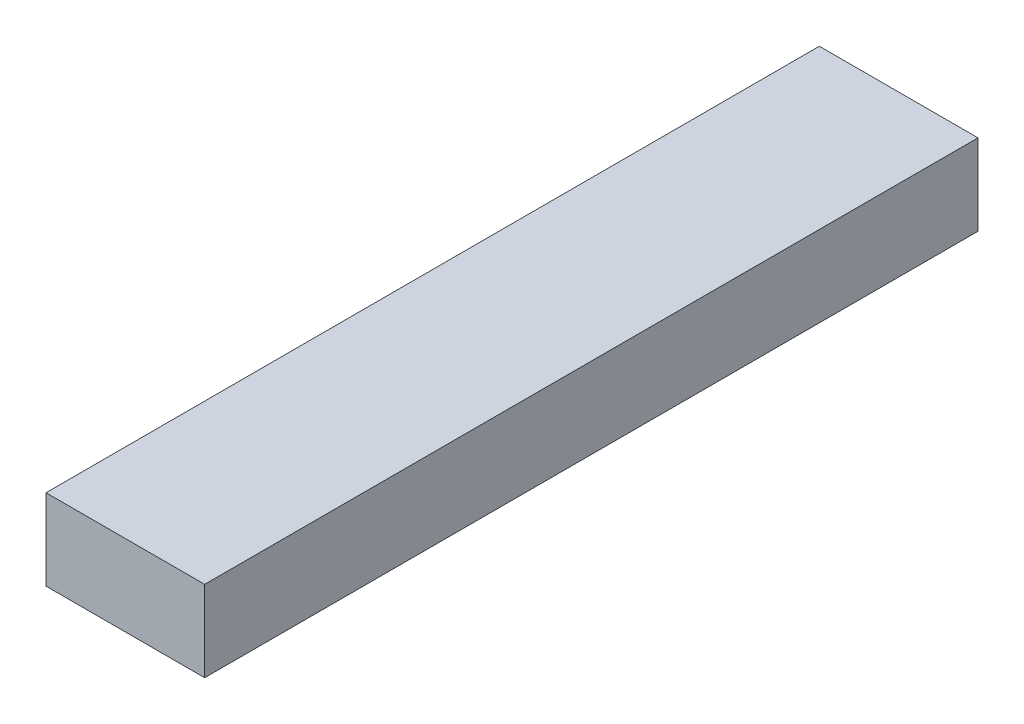
ISO-10303-21;
HEADER;
FILE_DESCRIPTION(('STEP AP214'),'2;1');
FILE_NAME('part.step','',(''),(''),'','','');
FILE_SCHEMA(('AUTOMOTIVE_DESIGN { 1 0 10303 214 1 1 1 1 }'));
ENDSEC;
DATA;
#1=APPLICATION_CONTEXT('core data for automotive mechanical design processes');
#2=APPLICATION_PROTOCOL_DEFINITION('international standard','automotive_design',2000,#1);
#3=PRODUCT_CONTEXT('',#1,'mechanical');
#4=PRODUCT('Part','Part','',(#3));
#5=PRODUCT_RELATED_PRODUCT_CATEGORY('part','',(#4));
#6=PRODUCT_DEFINITION_FORMATION('','',#4);
#7=PRODUCT_DEFINITION_CONTEXT('part definition',#1,'design');
#8=PRODUCT_DEFINITION('design','',#6,#7);
#9=PRODUCT_DEFINITION_SHAPE('','',#8);
#10=(LENGTH_UNIT() NAMED_UNIT(*) SI_UNIT(.MILLI.,.METRE.));
#11=(NAMED_UNIT(*) PLANE_ANGLE_UNIT() SI_UNIT($,.RADIAN.));
#12=(NAMED_UNIT(*) SI_UNIT($,.STERADIAN.) SOLID_ANGLE_UNIT());
#13=UNCERTAINTY_MEASURE_WITH_UNIT(LENGTH_MEASURE(1.E-05),#10,'distance_accuracy_value','');
#14=(GEOMETRIC_REPRESENTATION_CONTEXT(3) GLOBAL_UNCERTAINTY_ASSIGNED_CONTEXT((#13)) GLOBAL_UNIT_ASSIGNED_CONTEXT((#10,
#11,#12)) REPRESENTATION_CONTEXT('',''));
#15=CARTESIAN_POINT('',(0.,0.,0.));
#16=DIRECTION('',(0.,0.,1.));
#17=DIRECTION('',(1.,0.,0.));
#18=AXIS2_PLACEMENT_3D('',#15,#16,#17);
#19=CARTESIAN_POINT('',(0.,7.7,0.));
#20=DIRECTION('',(1.,0.,0.));
#21=DIRECTION('',(0.,0.,-1.));
#22=AXIS2_PLACEMENT_3D('',#19,#20,#21);
#23=PLANE('',#22);
#24=DIRECTION('',(0.,0.,1.));
#25=VECTOR('',#24,1.);
#26=CARTESIAN_POINT('',(0.,0.,0.));
#27=LINE('',#26,#25);
#28=CARTESIAN_POINT('',(0.,0.,-73.6));
#29=VERTEX_POINT('',#28);
#30=CARTESIAN_POINT('',(0.,0.,0.));
#31=VERTEX_POINT('',#30);
#32=EDGE_CURVE('E95',#29,#31,#27,.T.);
#33=ORIENTED_EDGE('',*,*,#32,.T.);
#34=DIRECTION('',(0.,-1.,0.));
#35=VECTOR('',#34,1.);
#36=CARTESIAN_POINT('',(0.,7.7,0.));
#37=LINE('',#36,#35);
#38=CARTESIAN_POINT('',(0.,7.7,0.));
#39=VERTEX_POINT('',#38);
#40=EDGE_CURVE('E11',#39,#31,#37,.T.);
#41=ORIENTED_EDGE('',*,*,#40,.F.);
#42=DIRECTION('',(0.,0.,1.));
#43=VECTOR('',#42,1.);
#44=CARTESIAN_POINT('',(0.,7.7,0.));
#45=LINE('',#44,#43);
#46=CARTESIAN_POINT('',(0.,7.7,-73.6));
#47=VERTEX_POINT('',#46);
#48=EDGE_CURVE('E83',#47,#39,#45,.T.);
#49=ORIENTED_EDGE('',*,*,#48,.F.);
#50=DIRECTION('',(0.,-1.,0.));
#51=VECTOR('',#50,1.);
#52=CARTESIAN_POINT('',(0.,7.7,-73.6));
#53=LINE('',#52,#51);
#54=EDGE_CURVE('E91',#47,#29,#53,.T.);
#55=ORIENTED_EDGE('',*,*,#54,.T.);
#56=EDGE_LOOP('',(#33,#41,#49,#55));
#57=FACE_BOUND('',#56,.T.);
#58=ADVANCED_FACE('F32',(#57),#23,.F.);
#59=CARTESIAN_POINT('',(0.,7.7,0.));
#60=DIRECTION('',(0.,0.,-1.));
#61=DIRECTION('',(-1.,0.,0.));
#62=AXIS2_PLACEMENT_3D('',#59,#60,#61);
#63=PLANE('',#62);
#64=DIRECTION('',(1.,0.,0.));
#65=VECTOR('',#64,1.);
#66=CARTESIAN_POINT('',(0.,0.,0.));
#67=LINE('',#66,#65);
#68=CARTESIAN_POINT('',(15.1,0.,0.));
#69=VERTEX_POINT('',#68);
#70=EDGE_CURVE('E87',#31,#69,#67,.T.);
#71=ORIENTED_EDGE('',*,*,#70,.T.);
#72=DIRECTION('',(0.,-1.,0.));
#73=VECTOR('',#72,1.);
#74=CARTESIAN_POINT('',(15.1,7.7,0.));
#75=LINE('',#74,#73);
#76=CARTESIAN_POINT('',(15.1,7.7,0.));
#77=VERTEX_POINT('',#76);
#78=EDGE_CURVE('E40',#77,#69,#75,.T.);
#79=ORIENTED_EDGE('',*,*,#78,.F.);
#80=DIRECTION('',(1.,0.,0.));
#81=VECTOR('',#80,1.);
#82=CARTESIAN_POINT('',(0.,7.7,0.));
#83=LINE('',#82,#81);
#84=EDGE_CURVE('E78',#39,#77,#83,.T.);
#85=ORIENTED_EDGE('',*,*,#84,.F.);
#86=ORIENTED_EDGE('',*,*,#40,.T.);
#87=EDGE_LOOP('',(#71,#79,#85,#86));
#88=FACE_BOUND('',#87,.T.);
#89=ADVANCED_FACE('F86',(#88),#63,.F.);
#90=CARTESIAN_POINT('',(15.1,7.7,0.));
#91=DIRECTION('',(-1.,0.,0.));
#92=DIRECTION('',(0.,0.,1.));
#93=AXIS2_PLACEMENT_3D('',#90,#91,#92);
#94=PLANE('',#93);
#95=DIRECTION('',(0.,0.,-1.));
#96=VECTOR('',#95,1.);
#97=CARTESIAN_POINT('',(15.1,0.,0.));
#98=LINE('',#97,#96);
#99=CARTESIAN_POINT('',(15.1,0.,-73.6));
#100=VERTEX_POINT('',#99);
#101=EDGE_CURVE('E65',#69,#100,#98,.T.);
#102=ORIENTED_EDGE('',*,*,#101,.T.);
#103=DIRECTION('',(0.,-1.,0.));
#104=VECTOR('',#103,1.);
#105=CARTESIAN_POINT('',(15.1,7.7,-73.6));
#106=LINE('',#105,#104);
#107=CARTESIAN_POINT('',(15.1,7.7,-73.6));
#108=VERTEX_POINT('',#107);
#109=EDGE_CURVE('E88',#108,#100,#106,.T.);
#110=ORIENTED_EDGE('',*,*,#109,.F.);
#111=DIRECTION('',(0.,0.,-1.));
#112=VECTOR('',#111,1.);
#113=CARTESIAN_POINT('',(15.1,7.7,0.));
#114=LINE('',#113,#112);
#115=EDGE_CURVE('E81',#77,#108,#114,.T.);
#116=ORIENTED_EDGE('',*,*,#115,.F.);
#117=ORIENTED_EDGE('',*,*,#78,.T.);
#118=EDGE_LOOP('',(#102,#110,#116,#117));
#119=FACE_BOUND('',#118,.T.);
#120=ADVANCED_FACE('F89',(#119),#94,.F.);
#121=CARTESIAN_POINT('',(0.,7.7,-73.6));
#122=DIRECTION('',(0.,0.,1.));
#123=DIRECTION('',(1.,0.,0.));
#124=AXIS2_PLACEMENT_3D('',#121,#122,#123);
#125=PLANE('',#124);
#126=DIRECTION('',(-1.,0.,0.));
#127=VECTOR('',#126,1.);
#128=CARTESIAN_POINT('',(0.,0.,-73.6));
#129=LINE('',#128,#127);
#130=EDGE_CURVE('E71',#100,#29,#129,.T.);
#131=ORIENTED_EDGE('',*,*,#130,.T.);
#132=ORIENTED_EDGE('',*,*,#54,.F.);
#133=DIRECTION('',(-1.,0.,0.));
#134=VECTOR('',#133,1.);
#135=CARTESIAN_POINT('',(0.,7.7,-73.6));
#136=LINE('',#135,#134);
#137=EDGE_CURVE('E48',#108,#47,#136,.T.);
#138=ORIENTED_EDGE('',*,*,#137,.F.);
#139=ORIENTED_EDGE('',*,*,#109,.T.);
#140=EDGE_LOOP('',(#131,#132,#138,#139));
#141=FACE_BOUND('',#140,.T.);
#142=ADVANCED_FACE('F102',(#141),#125,.F.);
#143=CARTESIAN_POINT('',(0.,7.7,0.));
#144=DIRECTION('',(0.,-1.,0.));
#145=DIRECTION('',(0.,0.,-1.));
#146=AXIS2_PLACEMENT_3D('',#143,#144,#145);
#147=PLANE('',#146);
#148=ORIENTED_EDGE('',*,*,#48,.T.);
#149=ORIENTED_EDGE('',*,*,#84,.T.);
#150=ORIENTED_EDGE('',*,*,#115,.T.);
#151=ORIENTED_EDGE('',*,*,#137,.T.);
#152=EDGE_LOOP('',(#148,#149,#150,#151));
#153=FACE_BOUND('',#152,.T.);
#154=ADVANCED_FACE('F79',(#153),#147,.F.);
#155=CARTESIAN_POINT('',(0.,0.,0.));
#156=DIRECTION('',(0.,-1.,0.));
#157=DIRECTION('',(0.,0.,-1.));
#158=AXIS2_PLACEMENT_3D('',#155,#156,#157);
#159=PLANE('',#158);
#160=ORIENTED_EDGE('',*,*,#32,.F.);
#161=ORIENTED_EDGE('',*,*,#130,.F.);
#162=ORIENTED_EDGE('',*,*,#101,.F.);
#163=ORIENTED_EDGE('',*,*,#70,.F.);
#164=EDGE_LOOP('',(#160,#161,#162,#163));
#165=FACE_BOUND('',#164,.T.);
#166=ADVANCED_FACE('F105',(#165),#159,.T.);
#167=CLOSED_SHELL('',(#58,#89,#120,#142,#154,#166));
#168=MANIFOLD_SOLID_BREP('B2',#167);
#169=ADVANCED_BREP_SHAPE_REPRESENTATION('',(#18,#168),#14);
#170=SHAPE_DEFINITION_REPRESENTATION(#9,#169);
ENDSEC;
END-ISO-10303-21;
